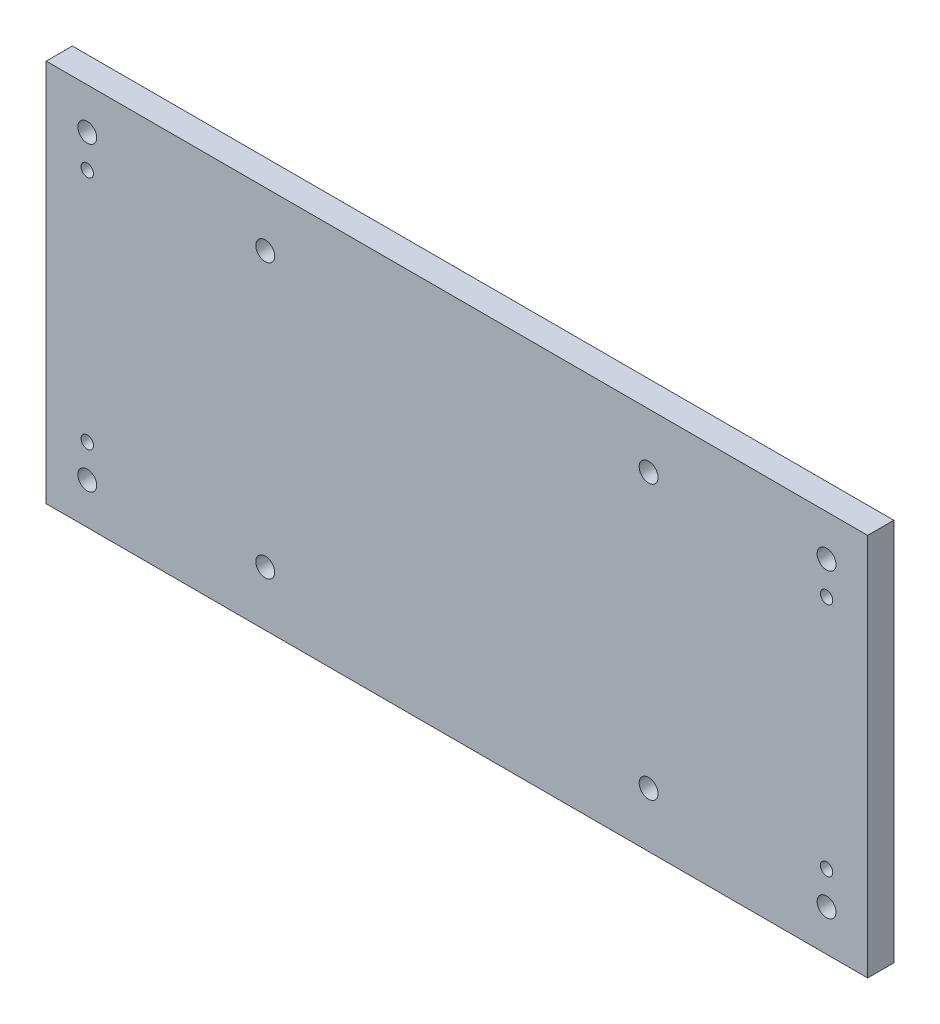
ISO-10303-21;
HEADER;
FILE_DESCRIPTION(('STEP AP214'),'2;1');
FILE_NAME('part.step','',(''),(''),'','','');
FILE_SCHEMA(('AUTOMOTIVE_DESIGN { 1 0 10303 214 1 1 1 1 }'));
ENDSEC;
DATA;
#1=APPLICATION_CONTEXT('core data for automotive mechanical design processes');
#2=APPLICATION_PROTOCOL_DEFINITION('international standard','automotive_design',2000,#1);
#3=PRODUCT_CONTEXT('',#1,'mechanical');
#4=PRODUCT('Part','Part','',(#3));
#5=PRODUCT_RELATED_PRODUCT_CATEGORY('part','',(#4));
#6=PRODUCT_DEFINITION_FORMATION('','',#4);
#7=PRODUCT_DEFINITION_CONTEXT('part definition',#1,'design');
#8=PRODUCT_DEFINITION('design','',#6,#7);
#9=PRODUCT_DEFINITION_SHAPE('','',#8);
#10=(LENGTH_UNIT() NAMED_UNIT(*) SI_UNIT(.MILLI.,.METRE.));
#11=(NAMED_UNIT(*) PLANE_ANGLE_UNIT() SI_UNIT($,.RADIAN.));
#12=(NAMED_UNIT(*) SI_UNIT($,.STERADIAN.) SOLID_ANGLE_UNIT());
#13=UNCERTAINTY_MEASURE_WITH_UNIT(LENGTH_MEASURE(1.E-05),#10,'distance_accuracy_value','');
#14=(GEOMETRIC_REPRESENTATION_CONTEXT(3) GLOBAL_UNCERTAINTY_ASSIGNED_CONTEXT((#13)) GLOBAL_UNIT_ASSIGNED_CONTEXT((#10,
#11,#12)) REPRESENTATION_CONTEXT('',''));
#15=CARTESIAN_POINT('',(0.,0.,0.));
#16=DIRECTION('',(0.,0.,1.));
#17=DIRECTION('',(1.,0.,0.));
#18=AXIS2_PLACEMENT_3D('',#15,#16,#17);
#19=CARTESIAN_POINT('',(150.,0.,4.7752));
#20=DIRECTION('',(1.,0.,0.));
#21=DIRECTION('',(0.,0.,-1.));
#22=AXIS2_PLACEMENT_3D('',#19,#20,#21);
#23=PLANE('',#22);
#24=DIRECTION('',(0.,-1.,0.));
#25=VECTOR('',#24,1.);
#26=CARTESIAN_POINT('',(150.,0.,0.));
#27=LINE('',#26,#25);
#28=CARTESIAN_POINT('',(150.,0.,0.));
#29=VERTEX_POINT('',#28);
#30=CARTESIAN_POINT('',(150.,-70.,0.));
#31=VERTEX_POINT('',#30);
#32=EDGE_CURVE('E156',#29,#31,#27,.T.);
#33=ORIENTED_EDGE('',*,*,#32,.F.);
#34=DIRECTION('',(0.,0.,-1.));
#35=VECTOR('',#34,1.);
#36=CARTESIAN_POINT('',(150.,0.,4.7752));
#37=LINE('',#36,#35);
#38=CARTESIAN_POINT('',(150.,0.,4.7752));
#39=VERTEX_POINT('',#38);
#40=EDGE_CURVE('E11',#39,#29,#37,.T.);
#41=ORIENTED_EDGE('',*,*,#40,.F.);
#42=DIRECTION('',(0.,-1.,0.));
#43=VECTOR('',#42,1.);
#44=CARTESIAN_POINT('',(150.,0.,4.7752));
#45=LINE('',#44,#43);
#46=CARTESIAN_POINT('',(150.,-70.,4.7752));
#47=VERTEX_POINT('',#46);
#48=EDGE_CURVE('E113',#39,#47,#45,.T.);
#49=ORIENTED_EDGE('',*,*,#48,.T.);
#50=DIRECTION('',(0.,0.,-1.));
#51=VECTOR('',#50,1.);
#52=CARTESIAN_POINT('',(150.,-70.,4.7752));
#53=LINE('',#52,#51);
#54=EDGE_CURVE('E90',#47,#31,#53,.T.);
#55=ORIENTED_EDGE('',*,*,#54,.T.);
#56=EDGE_LOOP('',(#33,#41,#49,#55));
#57=FACE_BOUND('',#56,.T.);
#58=ADVANCED_FACE('F49',(#57),#23,.T.);
#59=CARTESIAN_POINT('',(0.,0.,4.7752));
#60=DIRECTION('',(0.,1.,0.));
#61=DIRECTION('',(0.,0.,1.));
#62=AXIS2_PLACEMENT_3D('',#59,#60,#61);
#63=PLANE('',#62);
#64=DIRECTION('',(1.,0.,0.));
#65=VECTOR('',#64,1.);
#66=CARTESIAN_POINT('',(0.,0.,0.));
#67=LINE('',#66,#65);
#68=CARTESIAN_POINT('',(0.,0.,0.));
#69=VERTEX_POINT('',#68);
#70=EDGE_CURVE('E102',#69,#29,#67,.T.);
#71=ORIENTED_EDGE('',*,*,#70,.F.);
#72=DIRECTION('',(0.,0.,-1.));
#73=VECTOR('',#72,1.);
#74=CARTESIAN_POINT('',(0.,0.,4.7752));
#75=LINE('',#74,#73);
#76=CARTESIAN_POINT('',(0.,0.,4.7752));
#77=VERTEX_POINT('',#76);
#78=EDGE_CURVE('E59',#77,#69,#75,.T.);
#79=ORIENTED_EDGE('',*,*,#78,.F.);
#80=DIRECTION('',(1.,0.,0.));
#81=VECTOR('',#80,1.);
#82=CARTESIAN_POINT('',(0.,0.,4.7752));
#83=LINE('',#82,#81);
#84=EDGE_CURVE('E100',#77,#39,#83,.T.);
#85=ORIENTED_EDGE('',*,*,#84,.T.);
#86=ORIENTED_EDGE('',*,*,#40,.T.);
#87=EDGE_LOOP('',(#71,#79,#85,#86));
#88=FACE_BOUND('',#87,.T.);
#89=ADVANCED_FACE('F98',(#88),#63,.T.);
#90=CARTESIAN_POINT('',(0.,0.,4.7752));
#91=DIRECTION('',(1.,0.,0.));
#92=DIRECTION('',(0.,1.,0.));
#93=AXIS2_PLACEMENT_3D('',#90,#91,#92);
#94=PLANE('',#93);
#95=DIRECTION('',(0.,-1.,0.));
#96=VECTOR('',#95,1.);
#97=CARTESIAN_POINT('',(0.,0.,0.));
#98=LINE('',#97,#96);
#99=CARTESIAN_POINT('',(0.,-70.,0.));
#100=VERTEX_POINT('',#99);
#101=EDGE_CURVE('E161',#69,#100,#98,.T.);
#102=ORIENTED_EDGE('',*,*,#101,.T.);
#103=DIRECTION('',(0.,0.,-1.));
#104=VECTOR('',#103,1.);
#105=CARTESIAN_POINT('',(0.,-70.,4.7752));
#106=LINE('',#105,#104);
#107=CARTESIAN_POINT('',(0.,-70.,4.7752));
#108=VERTEX_POINT('',#107);
#109=EDGE_CURVE('E106',#108,#100,#106,.T.);
#110=ORIENTED_EDGE('',*,*,#109,.F.);
#111=DIRECTION('',(0.,-1.,0.));
#112=VECTOR('',#111,1.);
#113=CARTESIAN_POINT('',(0.,0.,4.7752));
#114=LINE('',#113,#112);
#115=EDGE_CURVE('E108',#77,#108,#114,.T.);
#116=ORIENTED_EDGE('',*,*,#115,.F.);
#117=ORIENTED_EDGE('',*,*,#78,.T.);
#118=EDGE_LOOP('',(#102,#110,#116,#117));
#119=FACE_BOUND('',#118,.T.);
#120=ADVANCED_FACE('F109',(#119),#94,.F.);
#121=CARTESIAN_POINT('',(7.49999999999998,-7.49999999999998,4.7752));
#122=DIRECTION('',(0.,0.,-1.));
#123=DIRECTION('',(-1.,0.,0.));
#124=AXIS2_PLACEMENT_3D('',#121,#122,#123);
#125=CYLINDRICAL_SURFACE('',#124,1.725);
#126=CARTESIAN_POINT('',(7.49999999999998,-7.49999999999998,4.7752));
#127=DIRECTION('',(0.,0.,1.));
#128=DIRECTION('',(1.,0.,0.));
#129=AXIS2_PLACEMENT_3D('',#126,#127,#128);
#130=CIRCLE('',#129,1.725);
#131=CARTESIAN_POINT('',(9.22499999999998,-7.49999999999998,4.7752));
#132=VERTEX_POINT('',#131);
#133=EDGE_CURVE('E117',#132,#132,#130,.T.);
#134=ORIENTED_EDGE('',*,*,#133,.T.);
#135=EDGE_LOOP('',(#134));
#136=FACE_BOUND('',#135,.T.);
#137=CARTESIAN_POINT('',(7.49999999999998,-7.49999999999998,0.));
#138=DIRECTION('',(0.,0.,1.));
#139=DIRECTION('',(1.,0.,0.));
#140=AXIS2_PLACEMENT_3D('',#137,#138,#139);
#141=CIRCLE('',#140,1.725);
#142=CARTESIAN_POINT('',(9.22499999999998,-7.49999999999998,0.));
#143=VERTEX_POINT('',#142);
#144=EDGE_CURVE('E152',#143,#143,#141,.T.);
#145=ORIENTED_EDGE('',*,*,#144,.F.);
#146=EDGE_LOOP('',(#145));
#147=FACE_BOUND('',#146,.T.);
#148=ADVANCED_FACE('F181',(#136,#147),#125,.F.);
#149=CARTESIAN_POINT('',(142.5,-7.49999999999999,4.7752));
#150=DIRECTION('',(0.,0.,-1.));
#151=DIRECTION('',(-1.,0.,0.));
#152=AXIS2_PLACEMENT_3D('',#149,#150,#151);
#153=CYLINDRICAL_SURFACE('',#152,1.72500000000002);
#154=CARTESIAN_POINT('',(142.5,-7.49999999999999,4.7752));
#155=DIRECTION('',(0.,0.,1.));
#156=DIRECTION('',(1.,0.,0.));
#157=AXIS2_PLACEMENT_3D('',#154,#155,#156);
#158=CIRCLE('',#157,1.72500000000002);
#159=CARTESIAN_POINT('',(144.225,-7.49999999999999,4.7752));
#160=VERTEX_POINT('',#159);
#161=EDGE_CURVE('E481',#160,#160,#158,.T.);
#162=ORIENTED_EDGE('',*,*,#161,.T.);
#163=EDGE_LOOP('',(#162));
#164=FACE_BOUND('',#163,.T.);
#165=CARTESIAN_POINT('',(142.5,-7.49999999999999,0.));
#166=DIRECTION('',(0.,0.,1.));
#167=DIRECTION('',(1.,0.,0.));
#168=AXIS2_PLACEMENT_3D('',#165,#166,#167);
#169=CIRCLE('',#168,1.72500000000002);
#170=CARTESIAN_POINT('',(144.225,-7.49999999999999,0.));
#171=VERTEX_POINT('',#170);
#172=EDGE_CURVE('E148',#171,#171,#169,.T.);
#173=ORIENTED_EDGE('',*,*,#172,.F.);
#174=EDGE_LOOP('',(#173));
#175=FACE_BOUND('',#174,.T.);
#176=ADVANCED_FACE('F184',(#164,#175),#153,.F.);
#177=CARTESIAN_POINT('',(142.5,-62.5,4.7752));
#178=DIRECTION('',(0.,0.,-1.));
#179=DIRECTION('',(-1.,0.,0.));
#180=AXIS2_PLACEMENT_3D('',#177,#178,#179);
#181=CYLINDRICAL_SURFACE('',#180,1.725);
#182=CARTESIAN_POINT('',(142.5,-62.5,4.7752));
#183=DIRECTION('',(0.,0.,1.));
#184=DIRECTION('',(1.,0.,0.));
#185=AXIS2_PLACEMENT_3D('',#182,#183,#184);
#186=CIRCLE('',#185,1.725);
#187=CARTESIAN_POINT('',(144.225,-62.5,4.7752));
#188=VERTEX_POINT('',#187);
#189=EDGE_CURVE('E477',#188,#188,#186,.T.);
#190=ORIENTED_EDGE('',*,*,#189,.T.);
#191=EDGE_LOOP('',(#190));
#192=FACE_BOUND('',#191,.T.);
#193=CARTESIAN_POINT('',(142.5,-62.5,0.));
#194=DIRECTION('',(0.,0.,1.));
#195=DIRECTION('',(1.,0.,0.));
#196=AXIS2_PLACEMENT_3D('',#193,#194,#195);
#197=CIRCLE('',#196,1.725);
#198=CARTESIAN_POINT('',(144.225,-62.5,0.));
#199=VERTEX_POINT('',#198);
#200=EDGE_CURVE('E144',#199,#199,#197,.T.);
#201=ORIENTED_EDGE('',*,*,#200,.F.);
#202=EDGE_LOOP('',(#201));
#203=FACE_BOUND('',#202,.T.);
#204=ADVANCED_FACE('F188',(#192,#203),#181,.F.);
#205=CARTESIAN_POINT('',(7.5,-62.5,4.7752));
#206=DIRECTION('',(0.,0.,-1.));
#207=DIRECTION('',(-1.,0.,0.));
#208=AXIS2_PLACEMENT_3D('',#205,#206,#207);
#209=CYLINDRICAL_SURFACE('',#208,1.72499999999999);
#210=CARTESIAN_POINT('',(7.5,-62.5,4.7752));
#211=DIRECTION('',(0.,0.,1.));
#212=DIRECTION('',(1.,0.,0.));
#213=AXIS2_PLACEMENT_3D('',#210,#211,#212);
#214=CIRCLE('',#213,1.72499999999999);
#215=CARTESIAN_POINT('',(9.22499999999999,-62.5,4.7752));
#216=VERTEX_POINT('',#215);
#217=EDGE_CURVE('E473',#216,#216,#214,.T.);
#218=ORIENTED_EDGE('',*,*,#217,.T.);
#219=EDGE_LOOP('',(#218));
#220=FACE_BOUND('',#219,.T.);
#221=CARTESIAN_POINT('',(7.5,-62.5,0.));
#222=DIRECTION('',(0.,0.,1.));
#223=DIRECTION('',(1.,0.,0.));
#224=AXIS2_PLACEMENT_3D('',#221,#222,#223);
#225=CIRCLE('',#224,1.72499999999999);
#226=CARTESIAN_POINT('',(9.22499999999999,-62.5,0.));
#227=VERTEX_POINT('',#226);
#228=EDGE_CURVE('E140',#227,#227,#225,.T.);
#229=ORIENTED_EDGE('',*,*,#228,.F.);
#230=EDGE_LOOP('',(#229));
#231=FACE_BOUND('',#230,.T.);
#232=ADVANCED_FACE('F192',(#220,#231),#209,.F.);
#233=CARTESIAN_POINT('',(40.,-10.,4.7752));
#234=DIRECTION('',(0.,0.,-1.));
#235=DIRECTION('',(-1.,0.,0.));
#236=AXIS2_PLACEMENT_3D('',#233,#234,#235);
#237=CYLINDRICAL_SURFACE('',#236,1.725);
#238=CARTESIAN_POINT('',(40.,-10.,4.7752));
#239=DIRECTION('',(0.,0.,1.));
#240=DIRECTION('',(1.,0.,0.));
#241=AXIS2_PLACEMENT_3D('',#238,#239,#240);
#242=CIRCLE('',#241,1.725);
#243=CARTESIAN_POINT('',(41.725,-10.,4.7752));
#244=VERTEX_POINT('',#243);
#245=EDGE_CURVE('E469',#244,#244,#242,.T.);
#246=ORIENTED_EDGE('',*,*,#245,.T.);
#247=EDGE_LOOP('',(#246));
#248=FACE_BOUND('',#247,.T.);
#249=CARTESIAN_POINT('',(40.,-10.,0.));
#250=DIRECTION('',(0.,0.,1.));
#251=DIRECTION('',(1.,0.,0.));
#252=AXIS2_PLACEMENT_3D('',#249,#250,#251);
#253=CIRCLE('',#252,1.725);
#254=CARTESIAN_POINT('',(41.725,-10.,0.));
#255=VERTEX_POINT('',#254);
#256=EDGE_CURVE('E136',#255,#255,#253,.T.);
#257=ORIENTED_EDGE('',*,*,#256,.F.);
#258=EDGE_LOOP('',(#257));
#259=FACE_BOUND('',#258,.T.);
#260=ADVANCED_FACE('F196',(#248,#259),#237,.F.);
#261=CARTESIAN_POINT('',(40.,-60.0000000000001,4.7752));
#262=DIRECTION('',(0.,0.,-1.));
#263=DIRECTION('',(-1.,0.,0.));
#264=AXIS2_PLACEMENT_3D('',#261,#262,#263);
#265=CYLINDRICAL_SURFACE('',#264,1.725);
#266=CARTESIAN_POINT('',(40.,-60.0000000000001,4.7752));
#267=DIRECTION('',(0.,0.,1.));
#268=DIRECTION('',(1.,0.,0.));
#269=AXIS2_PLACEMENT_3D('',#266,#267,#268);
#270=CIRCLE('',#269,1.725);
#271=CARTESIAN_POINT('',(41.725,-60.0000000000001,4.7752));
#272=VERTEX_POINT('',#271);
#273=EDGE_CURVE('E465',#272,#272,#270,.T.);
#274=ORIENTED_EDGE('',*,*,#273,.T.);
#275=EDGE_LOOP('',(#274));
#276=FACE_BOUND('',#275,.T.);
#277=CARTESIAN_POINT('',(40.,-60.0000000000001,0.));
#278=DIRECTION('',(0.,0.,1.));
#279=DIRECTION('',(1.,0.,0.));
#280=AXIS2_PLACEMENT_3D('',#277,#278,#279);
#281=CIRCLE('',#280,1.725);
#282=CARTESIAN_POINT('',(41.725,-60.0000000000001,0.));
#283=VERTEX_POINT('',#282);
#284=EDGE_CURVE('E132',#283,#283,#281,.T.);
#285=ORIENTED_EDGE('',*,*,#284,.F.);
#286=EDGE_LOOP('',(#285));
#287=FACE_BOUND('',#286,.T.);
#288=ADVANCED_FACE('F200',(#276,#287),#265,.F.);
#289=CARTESIAN_POINT('',(110.,-10.,4.7752));
#290=DIRECTION('',(0.,0.,-1.));
#291=DIRECTION('',(-1.,0.,0.));
#292=AXIS2_PLACEMENT_3D('',#289,#290,#291);
#293=CYLINDRICAL_SURFACE('',#292,1.725);
#294=CARTESIAN_POINT('',(110.,-10.,4.7752));
#295=DIRECTION('',(0.,0.,1.));
#296=DIRECTION('',(1.,0.,0.));
#297=AXIS2_PLACEMENT_3D('',#294,#295,#296);
#298=CIRCLE('',#297,1.725);
#299=CARTESIAN_POINT('',(111.725,-10.,4.7752));
#300=VERTEX_POINT('',#299);
#301=EDGE_CURVE('E214',#300,#300,#298,.T.);
#302=ORIENTED_EDGE('',*,*,#301,.T.);
#303=EDGE_LOOP('',(#302));
#304=FACE_BOUND('',#303,.T.);
#305=CARTESIAN_POINT('',(110.,-10.,0.));
#306=DIRECTION('',(0.,0.,1.));
#307=DIRECTION('',(1.,0.,0.));
#308=AXIS2_PLACEMENT_3D('',#305,#306,#307);
#309=CIRCLE('',#308,1.725);
#310=CARTESIAN_POINT('',(111.725,-10.,0.));
#311=VERTEX_POINT('',#310);
#312=EDGE_CURVE('E127',#311,#311,#309,.T.);
#313=ORIENTED_EDGE('',*,*,#312,.F.);
#314=EDGE_LOOP('',(#313));
#315=FACE_BOUND('',#314,.T.);
#316=ADVANCED_FACE('F203',(#304,#315),#293,.F.);
#317=CARTESIAN_POINT('',(110.,-60.0000000000001,4.7752));
#318=DIRECTION('',(0.,0.,-1.));
#319=DIRECTION('',(-1.,0.,0.));
#320=AXIS2_PLACEMENT_3D('',#317,#318,#319);
#321=CYLINDRICAL_SURFACE('',#320,1.725);
#322=CARTESIAN_POINT('',(110.,-60.0000000000001,4.7752));
#323=DIRECTION('',(0.,0.,1.));
#324=DIRECTION('',(1.,0.,0.));
#325=AXIS2_PLACEMENT_3D('',#322,#323,#324);
#326=CIRCLE('',#325,1.725);
#327=CARTESIAN_POINT('',(111.725,-60.0000000000001,4.7752));
#328=VERTEX_POINT('',#327);
#329=EDGE_CURVE('E166',#328,#328,#326,.T.);
#330=ORIENTED_EDGE('',*,*,#329,.T.);
#331=EDGE_LOOP('',(#330));
#332=FACE_BOUND('',#331,.T.);
#333=CARTESIAN_POINT('',(110.,-60.0000000000001,0.));
#334=DIRECTION('',(0.,0.,1.));
#335=DIRECTION('',(1.,0.,0.));
#336=AXIS2_PLACEMENT_3D('',#333,#334,#335);
#337=CIRCLE('',#336,1.725);
#338=CARTESIAN_POINT('',(111.725,-60.0000000000001,0.));
#339=VERTEX_POINT('',#338);
#340=EDGE_CURVE('E123',#339,#339,#337,.T.);
#341=ORIENTED_EDGE('',*,*,#340,.F.);
#342=EDGE_LOOP('',(#341));
#343=FACE_BOUND('',#342,.T.);
#344=ADVANCED_FACE('F51',(#332,#343),#321,.F.);
#345=CARTESIAN_POINT('',(0.,-70.,4.7752));
#346=DIRECTION('',(0.,1.,0.));
#347=DIRECTION('',(0.,0.,1.));
#348=AXIS2_PLACEMENT_3D('',#345,#346,#347);
#349=PLANE('',#348);
#350=DIRECTION('',(1.,0.,0.));
#351=VECTOR('',#350,1.);
#352=CARTESIAN_POINT('',(0.,-70.,0.));
#353=LINE('',#352,#351);
#354=EDGE_CURVE('E83',#100,#31,#353,.T.);
#355=ORIENTED_EDGE('',*,*,#354,.T.);
#356=ORIENTED_EDGE('',*,*,#54,.F.);
#357=DIRECTION('',(1.,0.,0.));
#358=VECTOR('',#357,1.);
#359=CARTESIAN_POINT('',(0.,-70.,4.7752));
#360=LINE('',#359,#358);
#361=EDGE_CURVE('E67',#108,#47,#360,.T.);
#362=ORIENTED_EDGE('',*,*,#361,.F.);
#363=ORIENTED_EDGE('',*,*,#109,.T.);
#364=EDGE_LOOP('',(#355,#356,#362,#363));
#365=FACE_BOUND('',#364,.T.);
#366=ADVANCED_FACE('F171',(#365),#349,.F.);
#367=CARTESIAN_POINT('',(0.,0.,4.7752));
#368=DIRECTION('',(0.,0.,1.));
#369=DIRECTION('',(1.,0.,0.));
#370=AXIS2_PLACEMENT_3D('',#367,#368,#369);
#371=PLANE('',#370);
#372=CARTESIAN_POINT('',(7.49999999999998,-13.5,4.7752));
#373=DIRECTION('',(0.,0.,1.));
#374=DIRECTION('',(1.,0.,0.));
#375=AXIS2_PLACEMENT_3D('',#372,#373,#374);
#376=CIRCLE('',#375,1.13029999999999);
#377=CARTESIAN_POINT('',(8.63029999999997,-13.5,4.7752));
#378=VERTEX_POINT('',#377);
#379=EDGE_CURVE('E431',#378,#378,#376,.T.);
#380=ORIENTED_EDGE('',*,*,#379,.F.);
#381=EDGE_LOOP('',(#380));
#382=FACE_BOUND('',#381,.T.);
#383=CARTESIAN_POINT('',(7.49999999999999,-56.5,4.7752));
#384=DIRECTION('',(0.,0.,1.));
#385=DIRECTION('',(1.,0.,0.));
#386=AXIS2_PLACEMENT_3D('',#383,#384,#385);
#387=CIRCLE('',#386,1.13029999999999);
#388=CARTESIAN_POINT('',(8.63029999999998,-56.5,4.7752));
#389=VERTEX_POINT('',#388);
#390=EDGE_CURVE('E435',#389,#389,#387,.T.);
#391=ORIENTED_EDGE('',*,*,#390,.F.);
#392=EDGE_LOOP('',(#391));
#393=FACE_BOUND('',#392,.T.);
#394=CARTESIAN_POINT('',(142.5,-56.5,4.7752));
#395=DIRECTION('',(0.,0.,1.));
#396=DIRECTION('',(1.,0.,0.));
#397=AXIS2_PLACEMENT_3D('',#394,#395,#396);
#398=CIRCLE('',#397,1.13029999999997);
#399=CARTESIAN_POINT('',(143.6303,-56.5,4.7752));
#400=VERTEX_POINT('',#399);
#401=EDGE_CURVE('E445',#400,#400,#398,.T.);
#402=ORIENTED_EDGE('',*,*,#401,.F.);
#403=EDGE_LOOP('',(#402));
#404=FACE_BOUND('',#403,.T.);
#405=CARTESIAN_POINT('',(142.5,-13.5,4.7752));
#406=DIRECTION('',(0.,0.,1.));
#407=DIRECTION('',(1.,0.,0.));
#408=AXIS2_PLACEMENT_3D('',#405,#406,#407);
#409=CIRCLE('',#408,1.13029999999997);
#410=CARTESIAN_POINT('',(143.6303,-13.5,4.7752));
#411=VERTEX_POINT('',#410);
#412=EDGE_CURVE('E453',#411,#411,#409,.T.);
#413=ORIENTED_EDGE('',*,*,#412,.F.);
#414=EDGE_LOOP('',(#413));
#415=FACE_BOUND('',#414,.T.);
#416=ORIENTED_EDGE('',*,*,#329,.F.);
#417=EDGE_LOOP('',(#416));
#418=FACE_BOUND('',#417,.T.);
#419=ORIENTED_EDGE('',*,*,#301,.F.);
#420=EDGE_LOOP('',(#419));
#421=FACE_BOUND('',#420,.T.);
#422=ORIENTED_EDGE('',*,*,#273,.F.);
#423=EDGE_LOOP('',(#422));
#424=FACE_BOUND('',#423,.T.);
#425=ORIENTED_EDGE('',*,*,#245,.F.);
#426=EDGE_LOOP('',(#425));
#427=FACE_BOUND('',#426,.T.);
#428=ORIENTED_EDGE('',*,*,#217,.F.);
#429=EDGE_LOOP('',(#428));
#430=FACE_BOUND('',#429,.T.);
#431=ORIENTED_EDGE('',*,*,#189,.F.);
#432=EDGE_LOOP('',(#431));
#433=FACE_BOUND('',#432,.T.);
#434=ORIENTED_EDGE('',*,*,#161,.F.);
#435=EDGE_LOOP('',(#434));
#436=FACE_BOUND('',#435,.T.);
#437=ORIENTED_EDGE('',*,*,#133,.F.);
#438=EDGE_LOOP('',(#437));
#439=FACE_BOUND('',#438,.T.);
#440=ORIENTED_EDGE('',*,*,#48,.F.);
#441=ORIENTED_EDGE('',*,*,#84,.F.);
#442=ORIENTED_EDGE('',*,*,#115,.T.);
#443=ORIENTED_EDGE('',*,*,#361,.T.);
#444=EDGE_LOOP('',(#440,#441,#442,#443));
#445=FACE_BOUND('',#444,.T.);
#446=ADVANCED_FACE('F112',(#382,#393,#404,#415,#418,#421,#424,#427,#430,#433,#436,#439,#445),
#371,.T.);
#447=CARTESIAN_POINT('',(0.,0.,0.));
#448=DIRECTION('',(0.,0.,1.));
#449=DIRECTION('',(1.,0.,0.));
#450=AXIS2_PLACEMENT_3D('',#447,#448,#449);
#451=PLANE('',#450);
#452=CARTESIAN_POINT('',(7.49999999999998,-13.5,0.));
#453=DIRECTION('',(0.,0.,1.));
#454=DIRECTION('',(1.,0.,0.));
#455=AXIS2_PLACEMENT_3D('',#452,#453,#454);
#456=CIRCLE('',#455,1.1303);
#457=CARTESIAN_POINT('',(8.63029999999998,-13.5,0.));
#458=VERTEX_POINT('',#457);
#459=EDGE_CURVE('E428',#458,#458,#456,.T.);
#460=ORIENTED_EDGE('',*,*,#459,.T.);
#461=EDGE_LOOP('',(#460));
#462=FACE_BOUND('',#461,.T.);
#463=CARTESIAN_POINT('',(7.49999999999999,-56.5,0.));
#464=DIRECTION('',(0.,0.,1.));
#465=DIRECTION('',(1.,0.,0.));
#466=AXIS2_PLACEMENT_3D('',#463,#464,#465);
#467=CIRCLE('',#466,1.1303);
#468=CARTESIAN_POINT('',(8.63029999999999,-56.5,0.));
#469=VERTEX_POINT('',#468);
#470=EDGE_CURVE('E441',#469,#469,#467,.T.);
#471=ORIENTED_EDGE('',*,*,#470,.T.);
#472=EDGE_LOOP('',(#471));
#473=FACE_BOUND('',#472,.T.);
#474=CARTESIAN_POINT('',(142.5,-56.5,0.));
#475=DIRECTION('',(0.,0.,1.));
#476=DIRECTION('',(1.,0.,0.));
#477=AXIS2_PLACEMENT_3D('',#474,#475,#476);
#478=CIRCLE('',#477,1.1303);
#479=CARTESIAN_POINT('',(143.6303,-56.5,0.));
#480=VERTEX_POINT('',#479);
#481=EDGE_CURVE('E449',#480,#480,#478,.T.);
#482=ORIENTED_EDGE('',*,*,#481,.T.);
#483=EDGE_LOOP('',(#482));
#484=FACE_BOUND('',#483,.T.);
#485=CARTESIAN_POINT('',(142.5,-13.5,0.));
#486=DIRECTION('',(0.,0.,1.));
#487=DIRECTION('',(1.,0.,0.));
#488=AXIS2_PLACEMENT_3D('',#485,#486,#487);
#489=CIRCLE('',#488,1.1303);
#490=CARTESIAN_POINT('',(143.6303,-13.5,0.));
#491=VERTEX_POINT('',#490);
#492=EDGE_CURVE('E128',#491,#491,#489,.T.);
#493=ORIENTED_EDGE('',*,*,#492,.T.);
#494=EDGE_LOOP('',(#493));
#495=FACE_BOUND('',#494,.T.);
#496=ORIENTED_EDGE('',*,*,#340,.T.);
#497=EDGE_LOOP('',(#496));
#498=FACE_BOUND('',#497,.T.);
#499=ORIENTED_EDGE('',*,*,#312,.T.);
#500=EDGE_LOOP('',(#499));
#501=FACE_BOUND('',#500,.T.);
#502=ORIENTED_EDGE('',*,*,#284,.T.);
#503=EDGE_LOOP('',(#502));
#504=FACE_BOUND('',#503,.T.);
#505=ORIENTED_EDGE('',*,*,#256,.T.);
#506=EDGE_LOOP('',(#505));
#507=FACE_BOUND('',#506,.T.);
#508=ORIENTED_EDGE('',*,*,#228,.T.);
#509=EDGE_LOOP('',(#508));
#510=FACE_BOUND('',#509,.T.);
#511=ORIENTED_EDGE('',*,*,#200,.T.);
#512=EDGE_LOOP('',(#511));
#513=FACE_BOUND('',#512,.T.);
#514=ORIENTED_EDGE('',*,*,#172,.T.);
#515=EDGE_LOOP('',(#514));
#516=FACE_BOUND('',#515,.T.);
#517=ORIENTED_EDGE('',*,*,#144,.T.);
#518=EDGE_LOOP('',(#517));
#519=FACE_BOUND('',#518,.T.);
#520=ORIENTED_EDGE('',*,*,#32,.T.);
#521=ORIENTED_EDGE('',*,*,#354,.F.);
#522=ORIENTED_EDGE('',*,*,#101,.F.);
#523=ORIENTED_EDGE('',*,*,#70,.T.);
#524=EDGE_LOOP('',(#520,#521,#522,#523));
#525=FACE_BOUND('',#524,.T.);
#526=ADVANCED_FACE('F172',(#462,#473,#484,#495,#498,#501,#504,#507,#510,#513,#516,#519,#525),
#451,.F.);
#527=CARTESIAN_POINT('',(142.5,-13.5,4.7752));
#528=DIRECTION('',(0.,0.,1.));
#529=DIRECTION('',(1.,0.,0.));
#530=AXIS2_PLACEMENT_3D('',#527,#528,#529);
#531=CYLINDRICAL_SURFACE('',#530,1.13029999999999);
#532=ORIENTED_EDGE('',*,*,#492,.F.);
#533=EDGE_LOOP('',(#532));
#534=FACE_BOUND('',#533,.T.);
#535=ORIENTED_EDGE('',*,*,#412,.T.);
#536=EDGE_LOOP('',(#535));
#537=FACE_BOUND('',#536,.T.);
#538=ADVANCED_FACE('F219',(#534,#537),#531,.F.);
#539=CARTESIAN_POINT('',(142.5,-56.5,4.7752));
#540=DIRECTION('',(0.,0.,1.));
#541=DIRECTION('',(1.,0.,0.));
#542=AXIS2_PLACEMENT_3D('',#539,#540,#541);
#543=CYLINDRICAL_SURFACE('',#542,1.13029999999999);
#544=ORIENTED_EDGE('',*,*,#481,.F.);
#545=EDGE_LOOP('',(#544));
#546=FACE_BOUND('',#545,.T.);
#547=ORIENTED_EDGE('',*,*,#401,.T.);
#548=EDGE_LOOP('',(#547));
#549=FACE_BOUND('',#548,.T.);
#550=ADVANCED_FACE('F243',(#546,#549),#543,.F.);
#551=CARTESIAN_POINT('',(7.49999999999999,-56.5,4.7752));
#552=DIRECTION('',(0.,0.,1.));
#553=DIRECTION('',(1.,0.,0.));
#554=AXIS2_PLACEMENT_3D('',#551,#552,#553);
#555=CYLINDRICAL_SURFACE('',#554,1.13029999999999);
#556=ORIENTED_EDGE('',*,*,#470,.F.);
#557=EDGE_LOOP('',(#556));
#558=FACE_BOUND('',#557,.T.);
#559=ORIENTED_EDGE('',*,*,#390,.T.);
#560=EDGE_LOOP('',(#559));
#561=FACE_BOUND('',#560,.T.);
#562=ADVANCED_FACE('F335',(#558,#561),#555,.F.);
#563=CARTESIAN_POINT('',(7.49999999999998,-13.5,4.7752));
#564=DIRECTION('',(0.,0.,1.));
#565=DIRECTION('',(1.,0.,0.));
#566=AXIS2_PLACEMENT_3D('',#563,#564,#565);
#567=CYLINDRICAL_SURFACE('',#566,1.13029999999999);
#568=ORIENTED_EDGE('',*,*,#459,.F.);
#569=EDGE_LOOP('',(#568));
#570=FACE_BOUND('',#569,.T.);
#571=ORIENTED_EDGE('',*,*,#379,.T.);
#572=EDGE_LOOP('',(#571));
#573=FACE_BOUND('',#572,.T.);
#574=ADVANCED_FACE('F347',(#570,#573),#567,.F.);
#575=CLOSED_SHELL('',(#58,#89,#120,#148,#176,#204,#232,#260,#288,#316,#344,#366,#446,#526,#538,
#550,#562,#574));
#576=MANIFOLD_SOLID_BREP('B2',#575);
#577=ADVANCED_BREP_SHAPE_REPRESENTATION('',(#18,#576),#14);
#578=SHAPE_DEFINITION_REPRESENTATION(#9,#577);
ENDSEC;
END-ISO-10303-21;
